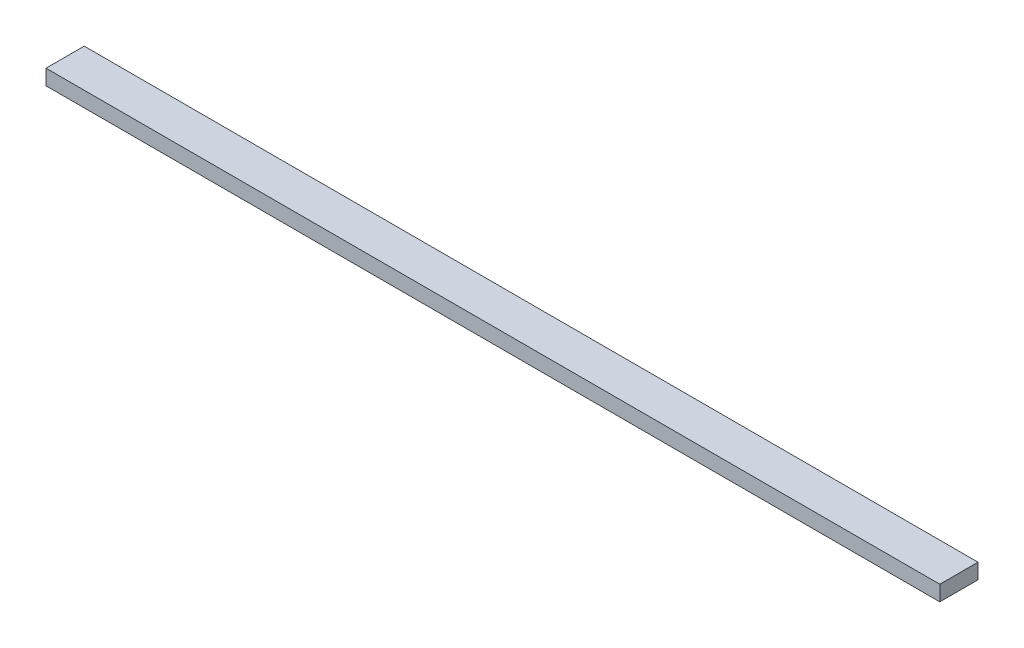
ISO-10303-21;
HEADER;
FILE_DESCRIPTION(('STEP AP214'),'2;1');
FILE_NAME('part.step','',(''),(''),'','','');
FILE_SCHEMA(('AUTOMOTIVE_DESIGN { 1 0 10303 214 1 1 1 1 }'));
ENDSEC;
DATA;
#1=APPLICATION_CONTEXT('core data for automotive mechanical design processes');
#2=APPLICATION_PROTOCOL_DEFINITION('international standard','automotive_design',2000,#1);
#3=PRODUCT_CONTEXT('',#1,'mechanical');
#4=PRODUCT('Part','Part','',(#3));
#5=PRODUCT_RELATED_PRODUCT_CATEGORY('part','',(#4));
#6=PRODUCT_DEFINITION_FORMATION('','',#4);
#7=PRODUCT_DEFINITION_CONTEXT('part definition',#1,'design');
#8=PRODUCT_DEFINITION('design','',#6,#7);
#9=PRODUCT_DEFINITION_SHAPE('','',#8);
#10=(LENGTH_UNIT() NAMED_UNIT(*) SI_UNIT(.MILLI.,.METRE.));
#11=(NAMED_UNIT(*) PLANE_ANGLE_UNIT() SI_UNIT($,.RADIAN.));
#12=(NAMED_UNIT(*) SI_UNIT($,.STERADIAN.) SOLID_ANGLE_UNIT());
#13=UNCERTAINTY_MEASURE_WITH_UNIT(LENGTH_MEASURE(1.E-05),#10,'distance_accuracy_value','');
#14=(GEOMETRIC_REPRESENTATION_CONTEXT(3) GLOBAL_UNCERTAINTY_ASSIGNED_CONTEXT((#13)) GLOBAL_UNIT_ASSIGNED_CONTEXT((#10,
#11,#12)) REPRESENTATION_CONTEXT('',''));
#15=CARTESIAN_POINT('',(0.,0.,0.));
#16=DIRECTION('',(0.,0.,1.));
#17=DIRECTION('',(1.,0.,0.));
#18=AXIS2_PLACEMENT_3D('',#15,#16,#17);
#19=CARTESIAN_POINT('',(1486.154,0.,0.));
#20=DIRECTION('',(0.,0.,-1.));
#21=DIRECTION('',(0.,1.,0.));
#22=AXIS2_PLACEMENT_3D('',#19,#20,#21);
#23=PLANE('',#22);
#24=DIRECTION('',(0.,-1.,0.));
#25=VECTOR('',#24,1.);
#26=CARTESIAN_POINT('',(0.,0.,0.));
#27=LINE('',#26,#25);
#28=CARTESIAN_POINT('',(0.,25.4,0.));
#29=VERTEX_POINT('',#28);
#30=CARTESIAN_POINT('',(0.,0.,0.));
#31=VERTEX_POINT('',#30);
#32=EDGE_CURVE('E110',#29,#31,#27,.T.);
#33=ORIENTED_EDGE('',*,*,#32,.T.);
#34=DIRECTION('',(-1.,0.,0.));
#35=VECTOR('',#34,1.);
#36=CARTESIAN_POINT('',(1486.154,0.,0.));
#37=LINE('',#36,#35);
#38=CARTESIAN_POINT('',(1486.154,0.,0.));
#39=VERTEX_POINT('',#38);
#40=EDGE_CURVE('E11',#39,#31,#37,.T.);
#41=ORIENTED_EDGE('',*,*,#40,.F.);
#42=DIRECTION('',(0.,-1.,0.));
#43=VECTOR('',#42,1.);
#44=CARTESIAN_POINT('',(1486.154,0.,0.));
#45=LINE('',#44,#43);
#46=CARTESIAN_POINT('',(1486.154,25.4,0.));
#47=VERTEX_POINT('',#46);
#48=EDGE_CURVE('E94',#47,#39,#45,.T.);
#49=ORIENTED_EDGE('',*,*,#48,.F.);
#50=DIRECTION('',(-1.,0.,0.));
#51=VECTOR('',#50,1.);
#52=CARTESIAN_POINT('',(1486.154,25.4,0.));
#53=LINE('',#52,#51);
#54=EDGE_CURVE('E106',#47,#29,#53,.T.);
#55=ORIENTED_EDGE('',*,*,#54,.T.);
#56=EDGE_LOOP('',(#33,#41,#49,#55));
#57=FACE_BOUND('',#56,.T.);
#58=ADVANCED_FACE('F42',(#57),#23,.F.);
#59=CARTESIAN_POINT('',(1486.154,0.,0.));
#60=DIRECTION('',(0.,1.,0.));
#61=DIRECTION('',(0.,0.,1.));
#62=AXIS2_PLACEMENT_3D('',#59,#60,#61);
#63=PLANE('',#62);
#64=DIRECTION('',(0.,0.,-1.));
#65=VECTOR('',#64,1.);
#66=CARTESIAN_POINT('',(0.,0.,0.));
#67=LINE('',#66,#65);
#68=CARTESIAN_POINT('',(0.,0.,-63.499998984));
#69=VERTEX_POINT('',#68);
#70=EDGE_CURVE('E99',#31,#69,#67,.T.);
#71=ORIENTED_EDGE('',*,*,#70,.T.);
#72=DIRECTION('',(-1.,0.,0.));
#73=VECTOR('',#72,1.);
#74=CARTESIAN_POINT('',(1486.154,0.,-63.499998984));
#75=LINE('',#74,#73);
#76=CARTESIAN_POINT('',(1486.154,0.,-63.499998984));
#77=VERTEX_POINT('',#76);
#78=EDGE_CURVE('E51',#77,#69,#75,.T.);
#79=ORIENTED_EDGE('',*,*,#78,.F.);
#80=DIRECTION('',(0.,0.,-1.));
#81=VECTOR('',#80,1.);
#82=CARTESIAN_POINT('',(1486.154,0.,0.));
#83=LINE('',#82,#81);
#84=EDGE_CURVE('E89',#39,#77,#83,.T.);
#85=ORIENTED_EDGE('',*,*,#84,.F.);
#86=ORIENTED_EDGE('',*,*,#40,.T.);
#87=EDGE_LOOP('',(#71,#79,#85,#86));
#88=FACE_BOUND('',#87,.T.);
#89=ADVANCED_FACE('F98',(#88),#63,.F.);
#90=CARTESIAN_POINT('',(1486.154,0.,-63.499998984));
#91=DIRECTION('',(0.,0.,1.));
#92=DIRECTION('',(1.,0.,0.));
#93=AXIS2_PLACEMENT_3D('',#90,#91,#92);
#94=PLANE('',#93);
#95=DIRECTION('',(0.,1.,0.));
#96=VECTOR('',#95,1.);
#97=CARTESIAN_POINT('',(0.,0.,-63.499998984));
#98=LINE('',#97,#96);
#99=CARTESIAN_POINT('',(0.,25.4,-63.499998984));
#100=VERTEX_POINT('',#99);
#101=EDGE_CURVE('E76',#69,#100,#98,.T.);
#102=ORIENTED_EDGE('',*,*,#101,.T.);
#103=DIRECTION('',(-1.,0.,0.));
#104=VECTOR('',#103,1.);
#105=CARTESIAN_POINT('',(1486.154,25.4,-63.499998984));
#106=LINE('',#105,#104);
#107=CARTESIAN_POINT('',(1486.154,25.4,-63.499998984));
#108=VERTEX_POINT('',#107);
#109=EDGE_CURVE('E101',#108,#100,#106,.T.);
#110=ORIENTED_EDGE('',*,*,#109,.F.);
#111=DIRECTION('',(0.,1.,0.));
#112=VECTOR('',#111,1.);
#113=CARTESIAN_POINT('',(1486.154,0.,-63.499998984));
#114=LINE('',#113,#112);
#115=EDGE_CURVE('E92',#77,#108,#114,.T.);
#116=ORIENTED_EDGE('',*,*,#115,.F.);
#117=ORIENTED_EDGE('',*,*,#78,.T.);
#118=EDGE_LOOP('',(#102,#110,#116,#117));
#119=FACE_BOUND('',#118,.T.);
#120=ADVANCED_FACE('F102',(#119),#94,.F.);
#121=CARTESIAN_POINT('',(1486.154,25.4,0.));
#122=DIRECTION('',(0.,-1.,0.));
#123=DIRECTION('',(0.,0.,-1.));
#124=AXIS2_PLACEMENT_3D('',#121,#122,#123);
#125=PLANE('',#124);
#126=DIRECTION('',(0.,0.,1.));
#127=VECTOR('',#126,1.);
#128=CARTESIAN_POINT('',(0.,25.4,0.));
#129=LINE('',#128,#127);
#130=EDGE_CURVE('E82',#100,#29,#129,.T.);
#131=ORIENTED_EDGE('',*,*,#130,.T.);
#132=ORIENTED_EDGE('',*,*,#54,.F.);
#133=DIRECTION('',(0.,0.,1.));
#134=VECTOR('',#133,1.);
#135=CARTESIAN_POINT('',(1486.154,25.4,0.));
#136=LINE('',#135,#134);
#137=EDGE_CURVE('E59',#108,#47,#136,.T.);
#138=ORIENTED_EDGE('',*,*,#137,.F.);
#139=ORIENTED_EDGE('',*,*,#109,.T.);
#140=EDGE_LOOP('',(#131,#132,#138,#139));
#141=FACE_BOUND('',#140,.T.);
#142=ADVANCED_FACE('F123',(#141),#125,.F.);
#143=CARTESIAN_POINT('',(1486.154,0.,0.));
#144=DIRECTION('',(-1.,0.,0.));
#145=DIRECTION('',(0.,0.,1.));
#146=AXIS2_PLACEMENT_3D('',#143,#144,#145);
#147=PLANE('',#146);
#148=ORIENTED_EDGE('',*,*,#48,.T.);
#149=ORIENTED_EDGE('',*,*,#84,.T.);
#150=ORIENTED_EDGE('',*,*,#115,.T.);
#151=ORIENTED_EDGE('',*,*,#137,.T.);
#152=EDGE_LOOP('',(#148,#149,#150,#151));
#153=FACE_BOUND('',#152,.T.);
#154=ADVANCED_FACE('F90',(#153),#147,.F.);
#155=CARTESIAN_POINT('',(0.,0.,0.));
#156=DIRECTION('',(-1.,0.,0.));
#157=DIRECTION('',(0.,0.,1.));
#158=AXIS2_PLACEMENT_3D('',#155,#156,#157);
#159=PLANE('',#158);
#160=ORIENTED_EDGE('',*,*,#32,.F.);
#161=ORIENTED_EDGE('',*,*,#130,.F.);
#162=ORIENTED_EDGE('',*,*,#101,.F.);
#163=ORIENTED_EDGE('',*,*,#70,.F.);
#164=EDGE_LOOP('',(#160,#161,#162,#163));
#165=FACE_BOUND('',#164,.T.);
#166=ADVANCED_FACE('F126',(#165),#159,.T.);
#167=CLOSED_SHELL('',(#58,#89,#120,#142,#154,#166));
#168=MANIFOLD_SOLID_BREP('B2',#167);
#169=ADVANCED_BREP_SHAPE_REPRESENTATION('',(#18,#168),#14);
#170=SHAPE_DEFINITION_REPRESENTATION(#9,#169);
ENDSEC;
END-ISO-10303-21;
